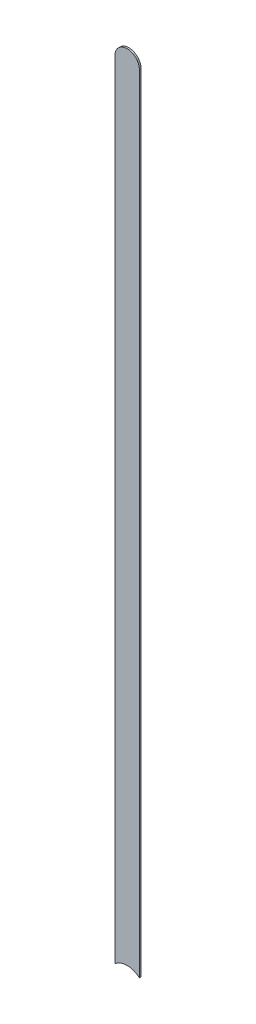
ISO-10303-21;
HEADER;
FILE_DESCRIPTION(('STEP AP214'),'2;1');
FILE_NAME('part.step','',(''),(''),'','','');
FILE_SCHEMA(('AUTOMOTIVE_DESIGN { 1 0 10303 214 1 1 1 1 }'));
ENDSEC;
DATA;
#1=APPLICATION_CONTEXT('core data for automotive mechanical design processes');
#2=APPLICATION_PROTOCOL_DEFINITION('international standard','automotive_design',2000,#1);
#3=PRODUCT_CONTEXT('',#1,'mechanical');
#4=PRODUCT('Part','Part','',(#3));
#5=PRODUCT_RELATED_PRODUCT_CATEGORY('part','',(#4));
#6=PRODUCT_DEFINITION_FORMATION('','',#4);
#7=PRODUCT_DEFINITION_CONTEXT('part definition',#1,'design');
#8=PRODUCT_DEFINITION('design','',#6,#7);
#9=PRODUCT_DEFINITION_SHAPE('','',#8);
#10=(LENGTH_UNIT() NAMED_UNIT(*) SI_UNIT(.MILLI.,.METRE.));
#11=(NAMED_UNIT(*) PLANE_ANGLE_UNIT() SI_UNIT($,.RADIAN.));
#12=(NAMED_UNIT(*) SI_UNIT($,.STERADIAN.) SOLID_ANGLE_UNIT());
#13=UNCERTAINTY_MEASURE_WITH_UNIT(LENGTH_MEASURE(1.E-05),#10,'distance_accuracy_value','');
#14=(GEOMETRIC_REPRESENTATION_CONTEXT(3) GLOBAL_UNCERTAINTY_ASSIGNED_CONTEXT((#13)) GLOBAL_UNIT_ASSIGNED_CONTEXT((#10,
#11,#12)) REPRESENTATION_CONTEXT('',''));
#15=CARTESIAN_POINT('',(0.,0.,0.));
#16=DIRECTION('',(0.,0.,1.));
#17=DIRECTION('',(1.,0.,0.));
#18=AXIS2_PLACEMENT_3D('',#15,#16,#17);
#19=CARTESIAN_POINT('',(169.93,-93.98,-0.035));
#20=DIRECTION('',(1.,0.,0.));
#21=DIRECTION('',(0.,1.,0.));
#22=AXIS2_PLACEMENT_3D('',#19,#20,#21);
#23=PLANE('',#22);
#24=DIRECTION('',(0.,0.,-1.));
#25=VECTOR('',#24,1.);
#26=CARTESIAN_POINT('',(169.93,-109.9564915028,-0.045));
#27=LINE('',#26,#25);
#28=CARTESIAN_POINT('',(169.93,-109.9564915027,0.));
#29=VERTEX_POINT('',#28);
#30=CARTESIAN_POINT('',(169.93,-109.9564915027,-0.035));
#31=VERTEX_POINT('',#30);
#32=EDGE_CURVE('E11',#29,#31,#27,.T.);
#33=ORIENTED_EDGE('',*,*,#32,.F.);
#34=DIRECTION('',(0.,-1.,0.));
#35=VECTOR('',#34,1.);
#36=CARTESIAN_POINT('',(169.93,-93.98,0.));
#37=LINE('',#36,#35);
#38=CARTESIAN_POINT('',(169.93,-93.98,0.));
#39=VERTEX_POINT('',#38);
#40=EDGE_CURVE('E26',#39,#29,#37,.T.);
#41=ORIENTED_EDGE('',*,*,#40,.F.);
#42=DIRECTION('',(0.,0.,1.));
#43=VECTOR('',#42,1.);
#44=CARTESIAN_POINT('',(169.93,-93.98,-0.035));
#45=LINE('',#44,#43);
#46=CARTESIAN_POINT('',(169.93,-93.98,-0.035));
#47=VERTEX_POINT('',#46);
#48=EDGE_CURVE('E62',#47,#39,#45,.T.);
#49=ORIENTED_EDGE('',*,*,#48,.F.);
#50=DIRECTION('',(0.,-1.,0.));
#51=VECTOR('',#50,1.);
#52=CARTESIAN_POINT('',(169.93,-93.98,-0.035));
#53=LINE('',#52,#51);
#54=EDGE_CURVE('E77',#47,#31,#53,.T.);
#55=ORIENTED_EDGE('',*,*,#54,.T.);
#56=EDGE_LOOP('',(#33,#41,#49,#55));
#57=FACE_BOUND('',#56,.T.);
#58=ADVANCED_FACE('F17',(#57),#23,.F.);
#59=CARTESIAN_POINT('',(170.18,-110.236,-0.045));
#60=DIRECTION('',(0.,0.,-1.));
#61=DIRECTION('',(0.,-1.,0.));
#62=AXIS2_PLACEMENT_3D('',#59,#60,#61);
#63=CYLINDRICAL_SURFACE('',#62,0.375);
#64=DIRECTION('',(0.,0.,-1.));
#65=VECTOR('',#64,1.);
#66=CARTESIAN_POINT('',(170.43,-109.9564915028,-0.045));
#67=LINE('',#66,#65);
#68=CARTESIAN_POINT('',(170.43,-109.9564915028,0.));
#69=VERTEX_POINT('',#68);
#70=CARTESIAN_POINT('',(170.43,-109.9564915028,-0.035));
#71=VERTEX_POINT('',#70);
#72=EDGE_CURVE('E92',#69,#71,#67,.T.);
#73=ORIENTED_EDGE('',*,*,#72,.F.);
#74=CARTESIAN_POINT('',(170.18,-110.236,0.));
#75=DIRECTION('',(0.,0.,-1.));
#76=DIRECTION('',(0.,-1.,0.));
#77=AXIS2_PLACEMENT_3D('',#74,#75,#76);
#78=CIRCLE('',#77,0.375);
#79=EDGE_CURVE('E73',#29,#69,#78,.T.);
#80=ORIENTED_EDGE('',*,*,#79,.F.);
#81=ORIENTED_EDGE('',*,*,#32,.T.);
#82=CARTESIAN_POINT('',(170.18,-110.236,-0.035));
#83=DIRECTION('',(0.,0.,-1.));
#84=DIRECTION('',(0.,-1.,0.));
#85=AXIS2_PLACEMENT_3D('',#82,#83,#84);
#86=CIRCLE('',#85,0.375);
#87=EDGE_CURVE('E71',#31,#71,#86,.T.);
#88=ORIENTED_EDGE('',*,*,#87,.T.);
#89=EDGE_LOOP('',(#73,#80,#81,#88));
#90=FACE_BOUND('',#89,.T.);
#91=ADVANCED_FACE('F70',(#90),#63,.F.);
#92=CARTESIAN_POINT('',(170.43,-110.236,0.));
#93=DIRECTION('',(0.,0.,1.));
#94=DIRECTION('',(1.,0.,0.));
#95=AXIS2_PLACEMENT_3D('',#92,#93,#94);
#96=PLANE('',#95);
#97=ORIENTED_EDGE('',*,*,#79,.T.);
#98=DIRECTION('',(0.,1.,0.));
#99=VECTOR('',#98,1.);
#100=CARTESIAN_POINT('',(170.43,-110.236,0.));
#101=LINE('',#100,#99);
#102=CARTESIAN_POINT('',(170.43,-93.98,0.));
#103=VERTEX_POINT('',#102);
#104=EDGE_CURVE('E114',#69,#103,#101,.T.);
#105=ORIENTED_EDGE('',*,*,#104,.T.);
#106=CARTESIAN_POINT('',(170.18,-93.98,0.));
#107=DIRECTION('',(0.,0.,1.));
#108=DIRECTION('',(1.,0.,0.));
#109=AXIS2_PLACEMENT_3D('',#106,#107,#108);
#110=CIRCLE('',#109,0.25);
#111=EDGE_CURVE('E99',#103,#39,#110,.T.);
#112=ORIENTED_EDGE('',*,*,#111,.T.);
#113=ORIENTED_EDGE('',*,*,#40,.T.);
#114=EDGE_LOOP('',(#97,#105,#112,#113));
#115=FACE_BOUND('',#114,.T.);
#116=ADVANCED_FACE('F124',(#115),#96,.T.);
#117=CARTESIAN_POINT('',(170.18,-93.98,-0.035));
#118=DIRECTION('',(0.,0.,-1.));
#119=DIRECTION('',(1.,0.,0.));
#120=AXIS2_PLACEMENT_3D('',#117,#118,#119);
#121=CYLINDRICAL_SURFACE('',#120,0.25);
#122=CARTESIAN_POINT('',(170.18,-93.98,-0.035));
#123=DIRECTION('',(0.,0.,1.));
#124=DIRECTION('',(1.,0.,0.));
#125=AXIS2_PLACEMENT_3D('',#122,#123,#124);
#126=CIRCLE('',#125,0.25);
#127=CARTESIAN_POINT('',(170.43,-93.98,-0.035));
#128=VERTEX_POINT('',#127);
#129=EDGE_CURVE('E82',#128,#47,#126,.T.);
#130=ORIENTED_EDGE('',*,*,#129,.T.);
#131=ORIENTED_EDGE('',*,*,#48,.T.);
#132=ORIENTED_EDGE('',*,*,#111,.F.);
#133=DIRECTION('',(0.,0.,1.));
#134=VECTOR('',#133,1.);
#135=CARTESIAN_POINT('',(170.43,-93.98,-0.035));
#136=LINE('',#135,#134);
#137=EDGE_CURVE('E113',#128,#103,#136,.T.);
#138=ORIENTED_EDGE('',*,*,#137,.F.);
#139=EDGE_LOOP('',(#130,#131,#132,#138));
#140=FACE_BOUND('',#139,.T.);
#141=ADVANCED_FACE('F126',(#140),#121,.T.);
#142=CARTESIAN_POINT('',(170.43,-110.236,-0.035));
#143=DIRECTION('',(0.,0.,1.));
#144=DIRECTION('',(1.,0.,0.));
#145=AXIS2_PLACEMENT_3D('',#142,#143,#144);
#146=PLANE('',#145);
#147=ORIENTED_EDGE('',*,*,#54,.F.);
#148=ORIENTED_EDGE('',*,*,#129,.F.);
#149=DIRECTION('',(0.,1.,0.));
#150=VECTOR('',#149,1.);
#151=CARTESIAN_POINT('',(170.43,-110.236,-0.035));
#152=LINE('',#151,#150);
#153=EDGE_CURVE('E79',#71,#128,#152,.T.);
#154=ORIENTED_EDGE('',*,*,#153,.F.);
#155=ORIENTED_EDGE('',*,*,#87,.F.);
#156=EDGE_LOOP('',(#147,#148,#154,#155));
#157=FACE_BOUND('',#156,.T.);
#158=ADVANCED_FACE('F76',(#157),#146,.F.);
#159=CARTESIAN_POINT('',(170.43,-110.236,-0.035));
#160=DIRECTION('',(-1.,0.,0.));
#161=DIRECTION('',(0.,0.,1.));
#162=AXIS2_PLACEMENT_3D('',#159,#160,#161);
#163=PLANE('',#162);
#164=ORIENTED_EDGE('',*,*,#137,.T.);
#165=ORIENTED_EDGE('',*,*,#104,.F.);
#166=ORIENTED_EDGE('',*,*,#72,.T.);
#167=ORIENTED_EDGE('',*,*,#153,.T.);
#168=EDGE_LOOP('',(#164,#165,#166,#167));
#169=FACE_BOUND('',#168,.T.);
#170=ADVANCED_FACE('F122',(#169),#163,.F.);
#171=CLOSED_SHELL('',(#58,#91,#116,#141,#158,#170));
#172=MANIFOLD_SOLID_BREP('B1',#171);
#173=ADVANCED_BREP_SHAPE_REPRESENTATION('',(#18,#172),#14);
#174=SHAPE_DEFINITION_REPRESENTATION(#9,#173);
ENDSEC;
END-ISO-10303-21;
